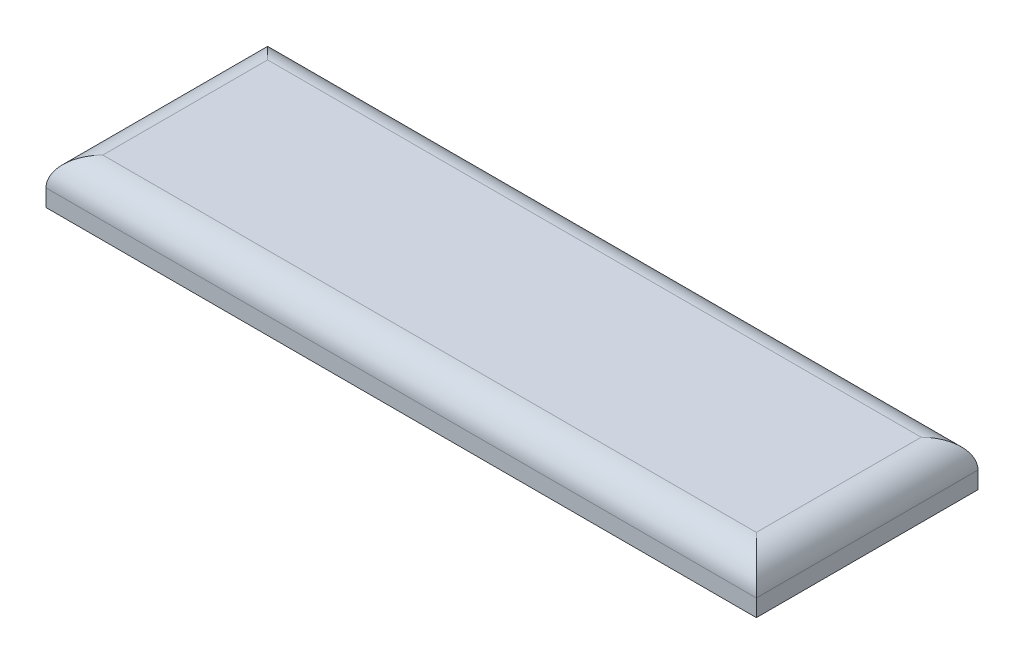
ISO-10303-21;
HEADER;
FILE_DESCRIPTION(('STEP AP214'),'2;1');
FILE_NAME('part.step','',(''),(''),'','','');
FILE_SCHEMA(('AUTOMOTIVE_DESIGN { 1 0 10303 214 1 1 1 1 }'));
ENDSEC;
DATA;
#1=APPLICATION_CONTEXT('core data for automotive mechanical design processes');
#2=APPLICATION_PROTOCOL_DEFINITION('international standard','automotive_design',2000,#1);
#3=PRODUCT_CONTEXT('',#1,'mechanical');
#4=PRODUCT('Part','Part','',(#3));
#5=PRODUCT_RELATED_PRODUCT_CATEGORY('part','',(#4));
#6=PRODUCT_DEFINITION_FORMATION('','',#4);
#7=PRODUCT_DEFINITION_CONTEXT('part definition',#1,'design');
#8=PRODUCT_DEFINITION('design','',#6,#7);
#9=PRODUCT_DEFINITION_SHAPE('','',#8);
#10=(LENGTH_UNIT() NAMED_UNIT(*) SI_UNIT(.MILLI.,.METRE.));
#11=(NAMED_UNIT(*) PLANE_ANGLE_UNIT() SI_UNIT($,.RADIAN.));
#12=(NAMED_UNIT(*) SI_UNIT($,.STERADIAN.) SOLID_ANGLE_UNIT());
#13=UNCERTAINTY_MEASURE_WITH_UNIT(LENGTH_MEASURE(1.E-05),#10,'distance_accuracy_value','');
#14=(GEOMETRIC_REPRESENTATION_CONTEXT(3) GLOBAL_UNCERTAINTY_ASSIGNED_CONTEXT((#13)) GLOBAL_UNIT_ASSIGNED_CONTEXT((#10,
#11,#12)) REPRESENTATION_CONTEXT('',''));
#15=CARTESIAN_POINT('',(0.,0.,0.));
#16=DIRECTION('',(0.,0.,1.));
#17=DIRECTION('',(1.,0.,0.));
#18=AXIS2_PLACEMENT_3D('',#15,#16,#17);
#19=CARTESIAN_POINT('',(12.5,1.6,-3.9));
#20=DIRECTION('',(-1.,0.,0.));
#21=DIRECTION('',(0.,0.,1.));
#22=AXIS2_PLACEMENT_3D('',#19,#20,#21);
#23=PLANE('',#22);
#24=DIRECTION('',(0.,-1.,0.));
#25=VECTOR('',#24,1.);
#26=CARTESIAN_POINT('',(12.5,1.6,-3.9));
#27=LINE('',#26,#25);
#28=CARTESIAN_POINT('',(12.5,0.6,-3.9));
#29=VERTEX_POINT('',#28);
#30=CARTESIAN_POINT('',(12.5,0.,-3.9));
#31=VERTEX_POINT('',#30);
#32=EDGE_CURVE('E98',#29,#31,#27,.T.);
#33=ORIENTED_EDGE('',*,*,#32,.F.);
#34=DIRECTION('',(0.,0.,-1.));
#35=VECTOR('',#34,1.);
#36=CARTESIAN_POINT('',(12.5,0.6,3.9));
#37=LINE('',#36,#35);
#38=CARTESIAN_POINT('',(12.5,0.6,3.9));
#39=VERTEX_POINT('',#38);
#40=EDGE_CURVE('E153',#29,#39,#37,.F.);
#41=ORIENTED_EDGE('',*,*,#40,.T.);
#42=DIRECTION('',(0.,-1.,0.));
#43=VECTOR('',#42,1.);
#44=CARTESIAN_POINT('',(12.5,1.6,3.9));
#45=LINE('',#44,#43);
#46=CARTESIAN_POINT('',(12.5,0.,3.9));
#47=VERTEX_POINT('',#46);
#48=EDGE_CURVE('E121',#39,#47,#45,.T.);
#49=ORIENTED_EDGE('',*,*,#48,.T.);
#50=DIRECTION('',(0.,0.,-1.));
#51=VECTOR('',#50,1.);
#52=CARTESIAN_POINT('',(12.5,0.,-3.9));
#53=LINE('',#52,#51);
#54=EDGE_CURVE('E116',#47,#31,#53,.T.);
#55=ORIENTED_EDGE('',*,*,#54,.T.);
#56=EDGE_LOOP('',(#33,#41,#49,#55));
#57=FACE_BOUND('',#56,.T.);
#58=ADVANCED_FACE('F43',(#57),#23,.F.);
#59=CARTESIAN_POINT('',(-12.5,1.6,-3.9));
#60=DIRECTION('',(0.,0.,1.));
#61=DIRECTION('',(1.,0.,0.));
#62=AXIS2_PLACEMENT_3D('',#59,#60,#61);
#63=PLANE('',#62);
#64=DIRECTION('',(0.,-1.,0.));
#65=VECTOR('',#64,1.);
#66=CARTESIAN_POINT('',(-12.5,1.6,-3.9));
#67=LINE('',#66,#65);
#68=CARTESIAN_POINT('',(-12.5,0.6,-3.9));
#69=VERTEX_POINT('',#68);
#70=CARTESIAN_POINT('',(-12.5,0.,-3.9));
#71=VERTEX_POINT('',#70);
#72=EDGE_CURVE('E110',#69,#71,#67,.T.);
#73=ORIENTED_EDGE('',*,*,#72,.F.);
#74=DIRECTION('',(-1.,0.,0.));
#75=VECTOR('',#74,1.);
#76=CARTESIAN_POINT('',(12.5,0.6,-3.9));
#77=LINE('',#76,#75);
#78=EDGE_CURVE('E53',#69,#29,#77,.F.);
#79=ORIENTED_EDGE('',*,*,#78,.T.);
#80=ORIENTED_EDGE('',*,*,#32,.T.);
#81=DIRECTION('',(-1.,0.,0.));
#82=VECTOR('',#81,1.);
#83=CARTESIAN_POINT('',(-12.5,0.,-3.9));
#84=LINE('',#83,#82);
#85=EDGE_CURVE('E101',#31,#71,#84,.T.);
#86=ORIENTED_EDGE('',*,*,#85,.T.);
#87=EDGE_LOOP('',(#73,#79,#80,#86));
#88=FACE_BOUND('',#87,.T.);
#89=ADVANCED_FACE('F100',(#88),#63,.F.);
#90=CARTESIAN_POINT('',(-12.5,1.6,-3.9));
#91=DIRECTION('',(1.,0.,0.));
#92=DIRECTION('',(0.,0.,-1.));
#93=AXIS2_PLACEMENT_3D('',#90,#91,#92);
#94=PLANE('',#93);
#95=DIRECTION('',(0.,-1.,0.));
#96=VECTOR('',#95,1.);
#97=CARTESIAN_POINT('',(-12.5,1.6,3.9));
#98=LINE('',#97,#96);
#99=CARTESIAN_POINT('',(-12.5,0.6,3.9));
#100=VERTEX_POINT('',#99);
#101=CARTESIAN_POINT('',(-12.5,0.,3.9));
#102=VERTEX_POINT('',#101);
#103=EDGE_CURVE('E136',#100,#102,#98,.T.);
#104=ORIENTED_EDGE('',*,*,#103,.F.);
#105=DIRECTION('',(0.,0.,1.));
#106=VECTOR('',#105,1.);
#107=CARTESIAN_POINT('',(-12.5,0.6,-3.9));
#108=LINE('',#107,#106);
#109=EDGE_CURVE('E11',#100,#69,#108,.F.);
#110=ORIENTED_EDGE('',*,*,#109,.T.);
#111=ORIENTED_EDGE('',*,*,#72,.T.);
#112=DIRECTION('',(0.,0.,1.));
#113=VECTOR('',#112,1.);
#114=CARTESIAN_POINT('',(-12.5,0.,-3.9));
#115=LINE('',#114,#113);
#116=EDGE_CURVE('E118',#71,#102,#115,.T.);
#117=ORIENTED_EDGE('',*,*,#116,.T.);
#118=EDGE_LOOP('',(#104,#110,#111,#117));
#119=FACE_BOUND('',#118,.T.);
#120=ADVANCED_FACE('F183',(#119),#94,.F.);
#121=CARTESIAN_POINT('',(-12.5,1.6,3.9));
#122=DIRECTION('',(0.,0.,-1.));
#123=DIRECTION('',(-1.,0.,0.));
#124=AXIS2_PLACEMENT_3D('',#121,#122,#123);
#125=PLANE('',#124);
#126=ORIENTED_EDGE('',*,*,#48,.F.);
#127=DIRECTION('',(1.,0.,0.));
#128=VECTOR('',#127,1.);
#129=CARTESIAN_POINT('',(-12.5,0.6,3.9));
#130=LINE('',#129,#128);
#131=EDGE_CURVE('E67',#39,#100,#130,.F.);
#132=ORIENTED_EDGE('',*,*,#131,.T.);
#133=ORIENTED_EDGE('',*,*,#103,.T.);
#134=DIRECTION('',(1.,0.,0.));
#135=VECTOR('',#134,1.);
#136=CARTESIAN_POINT('',(-12.5,0.,3.9));
#137=LINE('',#136,#135);
#138=EDGE_CURVE('E131',#102,#47,#137,.T.);
#139=ORIENTED_EDGE('',*,*,#138,.T.);
#140=EDGE_LOOP('',(#126,#132,#133,#139));
#141=FACE_BOUND('',#140,.T.);
#142=ADVANCED_FACE('F182',(#141),#125,.F.);
#143=CARTESIAN_POINT('',(0.,1.6,0.));
#144=DIRECTION('',(0.,1.,0.));
#145=DIRECTION('',(0.,0.,1.));
#146=AXIS2_PLACEMENT_3D('',#143,#144,#145);
#147=PLANE('',#146);
#148=DIRECTION('',(1.,0.,0.));
#149=VECTOR('',#148,1.);
#150=CARTESIAN_POINT('',(12.5,1.6,2.9));
#151=LINE('',#150,#149);
#152=CARTESIAN_POINT('',(-11.5,1.6,2.9));
#153=VERTEX_POINT('',#152);
#154=CARTESIAN_POINT('',(11.5,1.6,2.9));
#155=VERTEX_POINT('',#154);
#156=EDGE_CURVE('E146',#153,#155,#151,.T.);
#157=ORIENTED_EDGE('',*,*,#156,.T.);
#158=DIRECTION('',(0.,0.,-1.));
#159=VECTOR('',#158,1.);
#160=CARTESIAN_POINT('',(11.5,1.6,-3.9));
#161=LINE('',#160,#159);
#162=CARTESIAN_POINT('',(11.5,1.6,-2.9));
#163=VERTEX_POINT('',#162);
#164=EDGE_CURVE('E149',#155,#163,#161,.T.);
#165=ORIENTED_EDGE('',*,*,#164,.T.);
#166=DIRECTION('',(-1.,0.,0.));
#167=VECTOR('',#166,1.);
#168=CARTESIAN_POINT('',(-12.5,1.6,-2.9));
#169=LINE('',#168,#167);
#170=CARTESIAN_POINT('',(-11.5,1.6,-2.9));
#171=VERTEX_POINT('',#170);
#172=EDGE_CURVE('E143',#163,#171,#169,.T.);
#173=ORIENTED_EDGE('',*,*,#172,.T.);
#174=DIRECTION('',(0.,0.,1.));
#175=VECTOR('',#174,1.);
#176=CARTESIAN_POINT('',(-11.5,1.6,3.9));
#177=LINE('',#176,#175);
#178=EDGE_CURVE('E109',#171,#153,#177,.T.);
#179=ORIENTED_EDGE('',*,*,#178,.T.);
#180=EDGE_LOOP('',(#157,#165,#173,#179));
#181=FACE_BOUND('',#180,.T.);
#182=ADVANCED_FACE('F177',(#181),#147,.T.);
#183=CARTESIAN_POINT('',(0.,0.,0.));
#184=DIRECTION('',(0.,1.,0.));
#185=DIRECTION('',(0.,0.,1.));
#186=AXIS2_PLACEMENT_3D('',#183,#184,#185);
#187=PLANE('',#186);
#188=ORIENTED_EDGE('',*,*,#54,.F.);
#189=ORIENTED_EDGE('',*,*,#138,.F.);
#190=ORIENTED_EDGE('',*,*,#116,.F.);
#191=ORIENTED_EDGE('',*,*,#85,.F.);
#192=EDGE_LOOP('',(#188,#189,#190,#191));
#193=FACE_BOUND('',#192,.T.);
#194=ADVANCED_FACE('F114',(#193),#187,.F.);
#195=CARTESIAN_POINT('',(-11.5,0.6,0.));
#196=DIRECTION('',(0.,0.,-1.));
#197=DIRECTION('',(-1.,0.,0.));
#198=AXIS2_PLACEMENT_3D('',#195,#196,#197);
#199=CYLINDRICAL_SURFACE('',#198,1.);
#200=CARTESIAN_POINT('',(-11.5,0.6,-2.9));
#201=DIRECTION('',(0.707106781186547,0.,-0.707106781186548));
#202=DIRECTION('',(-0.707106781186548,0.,-0.707106781186547));
#203=AXIS2_PLACEMENT_3D('',#200,#201,#202);
#204=ELLIPSE('',#203,1.4142135623731,1.);
#205=EDGE_CURVE('E127',#69,#171,#204,.T.);
#206=ORIENTED_EDGE('',*,*,#205,.F.);
#207=ORIENTED_EDGE('',*,*,#109,.F.);
#208=CARTESIAN_POINT('',(-11.5,0.6,2.9));
#209=DIRECTION('',(-0.707106781186548,0.,-0.707106781186547));
#210=DIRECTION('',(0.707106781186547,0.,-0.707106781186548));
#211=AXIS2_PLACEMENT_3D('',#208,#209,#210);
#212=ELLIPSE('',#211,1.41421356237309,1.);
#213=EDGE_CURVE('E47',#153,#100,#212,.F.);
#214=ORIENTED_EDGE('',*,*,#213,.F.);
#215=ORIENTED_EDGE('',*,*,#178,.F.);
#216=EDGE_LOOP('',(#206,#207,#214,#215));
#217=FACE_BOUND('',#216,.T.);
#218=ADVANCED_FACE('F45',(#217),#199,.T.);
#219=CARTESIAN_POINT('',(0.,0.6,2.9));
#220=DIRECTION('',(-1.,0.,0.));
#221=DIRECTION('',(0.,0.,1.));
#222=AXIS2_PLACEMENT_3D('',#219,#220,#221);
#223=CYLINDRICAL_SURFACE('',#222,1.);
#224=ORIENTED_EDGE('',*,*,#213,.T.);
#225=ORIENTED_EDGE('',*,*,#131,.F.);
#226=CARTESIAN_POINT('',(11.5,0.6,2.9));
#227=DIRECTION('',(-0.707106781186548,0.,0.707106781186547));
#228=DIRECTION('',(-0.707106781186547,0.,-0.707106781186548));
#229=AXIS2_PLACEMENT_3D('',#226,#227,#228);
#230=ELLIPSE('',#229,1.41421356237309,1.);
#231=EDGE_CURVE('E163',#155,#39,#230,.F.);
#232=ORIENTED_EDGE('',*,*,#231,.F.);
#233=ORIENTED_EDGE('',*,*,#156,.F.);
#234=EDGE_LOOP('',(#224,#225,#232,#233));
#235=FACE_BOUND('',#234,.T.);
#236=ADVANCED_FACE('F200',(#235),#223,.T.);
#237=CARTESIAN_POINT('',(0.,0.6,-2.9));
#238=DIRECTION('',(1.,0.,0.));
#239=DIRECTION('',(0.,0.,-1.));
#240=AXIS2_PLACEMENT_3D('',#237,#238,#239);
#241=CYLINDRICAL_SURFACE('',#240,1.);
#242=ORIENTED_EDGE('',*,*,#205,.T.);
#243=ORIENTED_EDGE('',*,*,#172,.F.);
#244=CARTESIAN_POINT('',(11.5,0.6,-2.9));
#245=DIRECTION('',(0.707106781186547,0.,0.707106781186548));
#246=DIRECTION('',(0.707106781186548,0.,-0.707106781186547));
#247=AXIS2_PLACEMENT_3D('',#244,#245,#246);
#248=ELLIPSE('',#247,1.4142135623731,1.);
#249=EDGE_CURVE('E160',#29,#163,#248,.T.);
#250=ORIENTED_EDGE('',*,*,#249,.F.);
#251=ORIENTED_EDGE('',*,*,#78,.F.);
#252=EDGE_LOOP('',(#242,#243,#250,#251));
#253=FACE_BOUND('',#252,.T.);
#254=ADVANCED_FACE('F170',(#253),#241,.T.);
#255=CARTESIAN_POINT('',(11.5,0.6,0.));
#256=DIRECTION('',(0.,0.,1.));
#257=DIRECTION('',(1.,0.,0.));
#258=AXIS2_PLACEMENT_3D('',#255,#256,#257);
#259=CYLINDRICAL_SURFACE('',#258,1.);
#260=ORIENTED_EDGE('',*,*,#231,.T.);
#261=ORIENTED_EDGE('',*,*,#40,.F.);
#262=ORIENTED_EDGE('',*,*,#249,.T.);
#263=ORIENTED_EDGE('',*,*,#164,.F.);
#264=EDGE_LOOP('',(#260,#261,#262,#263));
#265=FACE_BOUND('',#264,.T.);
#266=ADVANCED_FACE('F181',(#265),#259,.T.);
#267=CLOSED_SHELL('',(#58,#89,#120,#142,#182,#194,#218,#236,#254,#266));
#268=MANIFOLD_SOLID_BREP('B2',#267);
#269=ADVANCED_BREP_SHAPE_REPRESENTATION('',(#18,#268),#14);
#270=SHAPE_DEFINITION_REPRESENTATION(#9,#269);
ENDSEC;
END-ISO-10303-21;
